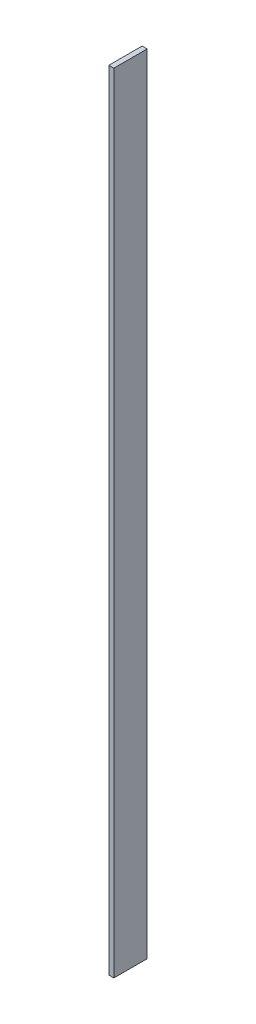
ISO-10303-21;
HEADER;
FILE_DESCRIPTION(('STEP AP214'),'2;1');
FILE_NAME('part.step','',(''),(''),'','','');
FILE_SCHEMA(('AUTOMOTIVE_DESIGN { 1 0 10303 214 1 1 1 1 }'));
ENDSEC;
DATA;
#1=APPLICATION_CONTEXT('core data for automotive mechanical design processes');
#2=APPLICATION_PROTOCOL_DEFINITION('international standard','automotive_design',2000,#1);
#3=PRODUCT_CONTEXT('',#1,'mechanical');
#4=PRODUCT('Part','Part','',(#3));
#5=PRODUCT_RELATED_PRODUCT_CATEGORY('part','',(#4));
#6=PRODUCT_DEFINITION_FORMATION('','',#4);
#7=PRODUCT_DEFINITION_CONTEXT('part definition',#1,'design');
#8=PRODUCT_DEFINITION('design','',#6,#7);
#9=PRODUCT_DEFINITION_SHAPE('','',#8);
#10=(LENGTH_UNIT() NAMED_UNIT(*) SI_UNIT(.MILLI.,.METRE.));
#11=(NAMED_UNIT(*) PLANE_ANGLE_UNIT() SI_UNIT($,.RADIAN.));
#12=(NAMED_UNIT(*) SI_UNIT($,.STERADIAN.) SOLID_ANGLE_UNIT());
#13=UNCERTAINTY_MEASURE_WITH_UNIT(LENGTH_MEASURE(1.E-05),#10,'distance_accuracy_value','');
#14=(GEOMETRIC_REPRESENTATION_CONTEXT(3) GLOBAL_UNCERTAINTY_ASSIGNED_CONTEXT((#13)) GLOBAL_UNIT_ASSIGNED_CONTEXT((#10,
#11,#12)) REPRESENTATION_CONTEXT('',''));
#15=CARTESIAN_POINT('',(0.,0.,0.));
#16=DIRECTION('',(0.,0.,1.));
#17=DIRECTION('',(1.,0.,0.));
#18=AXIS2_PLACEMENT_3D('',#15,#16,#17);
#19=CARTESIAN_POINT('',(2.38125,0.,0.));
#20=DIRECTION('',(0.,0.,-1.));
#21=DIRECTION('',(-1.,0.,0.));
#22=AXIS2_PLACEMENT_3D('',#19,#20,#21);
#23=PLANE('',#22);
#24=DIRECTION('',(0.,-1.,0.));
#25=VECTOR('',#24,1.);
#26=CARTESIAN_POINT('',(0.,0.,0.));
#27=LINE('',#26,#25);
#28=CARTESIAN_POINT('',(0.,374.65,0.));
#29=VERTEX_POINT('',#28);
#30=CARTESIAN_POINT('',(0.,0.,0.));
#31=VERTEX_POINT('',#30);
#32=EDGE_CURVE('E95',#29,#31,#27,.T.);
#33=ORIENTED_EDGE('',*,*,#32,.T.);
#34=DIRECTION('',(-1.,0.,0.));
#35=VECTOR('',#34,1.);
#36=CARTESIAN_POINT('',(2.38125,0.,0.));
#37=LINE('',#36,#35);
#38=CARTESIAN_POINT('',(2.38125,0.,0.));
#39=VERTEX_POINT('',#38);
#40=EDGE_CURVE('E11',#39,#31,#37,.T.);
#41=ORIENTED_EDGE('',*,*,#40,.F.);
#42=DIRECTION('',(0.,-1.,0.));
#43=VECTOR('',#42,1.);
#44=CARTESIAN_POINT('',(2.38125,0.,0.));
#45=LINE('',#44,#43);
#46=CARTESIAN_POINT('',(2.38125,374.65,0.));
#47=VERTEX_POINT('',#46);
#48=EDGE_CURVE('E83',#47,#39,#45,.T.);
#49=ORIENTED_EDGE('',*,*,#48,.F.);
#50=DIRECTION('',(-1.,0.,0.));
#51=VECTOR('',#50,1.);
#52=CARTESIAN_POINT('',(2.38125,374.65,0.));
#53=LINE('',#52,#51);
#54=EDGE_CURVE('E91',#47,#29,#53,.T.);
#55=ORIENTED_EDGE('',*,*,#54,.T.);
#56=EDGE_LOOP('',(#33,#41,#49,#55));
#57=FACE_BOUND('',#56,.T.);
#58=ADVANCED_FACE('F32',(#57),#23,.F.);
#59=CARTESIAN_POINT('',(2.38125,0.,0.));
#60=DIRECTION('',(0.,1.,0.));
#61=DIRECTION('',(0.,0.,1.));
#62=AXIS2_PLACEMENT_3D('',#59,#60,#61);
#63=PLANE('',#62);
#64=DIRECTION('',(0.,0.,-1.));
#65=VECTOR('',#64,1.);
#66=CARTESIAN_POINT('',(0.,0.,0.));
#67=LINE('',#66,#65);
#68=CARTESIAN_POINT('',(0.,0.,-15.875));
#69=VERTEX_POINT('',#68);
#70=EDGE_CURVE('E87',#31,#69,#67,.T.);
#71=ORIENTED_EDGE('',*,*,#70,.T.);
#72=DIRECTION('',(-1.,0.,0.));
#73=VECTOR('',#72,1.);
#74=CARTESIAN_POINT('',(2.38125,0.,-15.875));
#75=LINE('',#74,#73);
#76=CARTESIAN_POINT('',(2.38125,0.,-15.875));
#77=VERTEX_POINT('',#76);
#78=EDGE_CURVE('E40',#77,#69,#75,.T.);
#79=ORIENTED_EDGE('',*,*,#78,.F.);
#80=DIRECTION('',(0.,0.,-1.));
#81=VECTOR('',#80,1.);
#82=CARTESIAN_POINT('',(2.38125,0.,0.));
#83=LINE('',#82,#81);
#84=EDGE_CURVE('E78',#39,#77,#83,.T.);
#85=ORIENTED_EDGE('',*,*,#84,.F.);
#86=ORIENTED_EDGE('',*,*,#40,.T.);
#87=EDGE_LOOP('',(#71,#79,#85,#86));
#88=FACE_BOUND('',#87,.T.);
#89=ADVANCED_FACE('F86',(#88),#63,.F.);
#90=CARTESIAN_POINT('',(2.38125,0.,-15.875));
#91=DIRECTION('',(0.,0.,1.));
#92=DIRECTION('',(1.,0.,0.));
#93=AXIS2_PLACEMENT_3D('',#90,#91,#92);
#94=PLANE('',#93);
#95=DIRECTION('',(0.,1.,0.));
#96=VECTOR('',#95,1.);
#97=CARTESIAN_POINT('',(0.,0.,-15.875));
#98=LINE('',#97,#96);
#99=CARTESIAN_POINT('',(0.,374.65,-15.875));
#100=VERTEX_POINT('',#99);
#101=EDGE_CURVE('E65',#69,#100,#98,.T.);
#102=ORIENTED_EDGE('',*,*,#101,.T.);
#103=DIRECTION('',(-1.,0.,0.));
#104=VECTOR('',#103,1.);
#105=CARTESIAN_POINT('',(2.38125,374.65,-15.875));
#106=LINE('',#105,#104);
#107=CARTESIAN_POINT('',(2.38125,374.65,-15.875));
#108=VERTEX_POINT('',#107);
#109=EDGE_CURVE('E88',#108,#100,#106,.T.);
#110=ORIENTED_EDGE('',*,*,#109,.F.);
#111=DIRECTION('',(0.,1.,0.));
#112=VECTOR('',#111,1.);
#113=CARTESIAN_POINT('',(2.38125,0.,-15.875));
#114=LINE('',#113,#112);
#115=EDGE_CURVE('E81',#77,#108,#114,.T.);
#116=ORIENTED_EDGE('',*,*,#115,.F.);
#117=ORIENTED_EDGE('',*,*,#78,.T.);
#118=EDGE_LOOP('',(#102,#110,#116,#117));
#119=FACE_BOUND('',#118,.T.);
#120=ADVANCED_FACE('F89',(#119),#94,.F.);
#121=CARTESIAN_POINT('',(2.38125,374.65,0.));
#122=DIRECTION('',(0.,-1.,0.));
#123=DIRECTION('',(0.,0.,-1.));
#124=AXIS2_PLACEMENT_3D('',#121,#122,#123);
#125=PLANE('',#124);
#126=DIRECTION('',(0.,0.,1.));
#127=VECTOR('',#126,1.);
#128=CARTESIAN_POINT('',(0.,374.65,0.));
#129=LINE('',#128,#127);
#130=EDGE_CURVE('E71',#100,#29,#129,.T.);
#131=ORIENTED_EDGE('',*,*,#130,.T.);
#132=ORIENTED_EDGE('',*,*,#54,.F.);
#133=DIRECTION('',(0.,0.,1.));
#134=VECTOR('',#133,1.);
#135=CARTESIAN_POINT('',(2.38125,374.65,0.));
#136=LINE('',#135,#134);
#137=EDGE_CURVE('E48',#108,#47,#136,.T.);
#138=ORIENTED_EDGE('',*,*,#137,.F.);
#139=ORIENTED_EDGE('',*,*,#109,.T.);
#140=EDGE_LOOP('',(#131,#132,#138,#139));
#141=FACE_BOUND('',#140,.T.);
#142=ADVANCED_FACE('F102',(#141),#125,.F.);
#143=CARTESIAN_POINT('',(2.38125,0.,0.));
#144=DIRECTION('',(-1.,0.,0.));
#145=DIRECTION('',(0.,0.,1.));
#146=AXIS2_PLACEMENT_3D('',#143,#144,#145);
#147=PLANE('',#146);
#148=ORIENTED_EDGE('',*,*,#48,.T.);
#149=ORIENTED_EDGE('',*,*,#84,.T.);
#150=ORIENTED_EDGE('',*,*,#115,.T.);
#151=ORIENTED_EDGE('',*,*,#137,.T.);
#152=EDGE_LOOP('',(#148,#149,#150,#151));
#153=FACE_BOUND('',#152,.T.);
#154=ADVANCED_FACE('F79',(#153),#147,.F.);
#155=CARTESIAN_POINT('',(0.,0.,0.));
#156=DIRECTION('',(-1.,0.,0.));
#157=DIRECTION('',(0.,0.,1.));
#158=AXIS2_PLACEMENT_3D('',#155,#156,#157);
#159=PLANE('',#158);
#160=ORIENTED_EDGE('',*,*,#32,.F.);
#161=ORIENTED_EDGE('',*,*,#130,.F.);
#162=ORIENTED_EDGE('',*,*,#101,.F.);
#163=ORIENTED_EDGE('',*,*,#70,.F.);
#164=EDGE_LOOP('',(#160,#161,#162,#163));
#165=FACE_BOUND('',#164,.T.);
#166=ADVANCED_FACE('F105',(#165),#159,.T.);
#167=CLOSED_SHELL('',(#58,#89,#120,#142,#154,#166));
#168=MANIFOLD_SOLID_BREP('B2',#167);
#169=ADVANCED_BREP_SHAPE_REPRESENTATION('',(#18,#168),#14);
#170=SHAPE_DEFINITION_REPRESENTATION(#9,#169);
ENDSEC;
END-ISO-10303-21;
